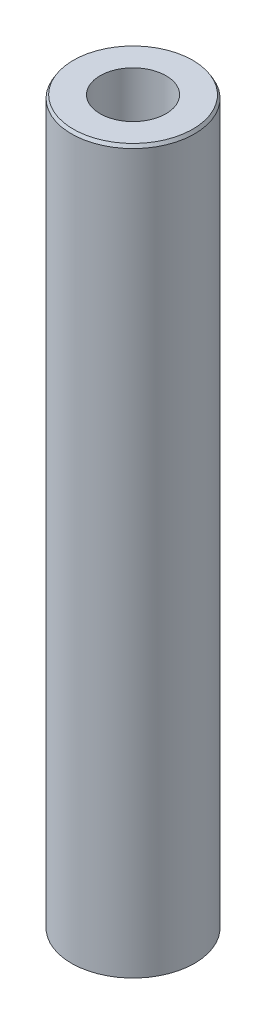
ISO-10303-21;
HEADER;
FILE_DESCRIPTION(('STEP AP214'),'2;1');
FILE_NAME('part.step','',(''),(''),'','','');
FILE_SCHEMA(('AUTOMOTIVE_DESIGN { 1 0 10303 214 1 1 1 1 }'));
ENDSEC;
DATA;
#1=APPLICATION_CONTEXT('core data for automotive mechanical design processes');
#2=APPLICATION_PROTOCOL_DEFINITION('international standard','automotive_design',2000,#1);
#3=PRODUCT_CONTEXT('',#1,'mechanical');
#4=PRODUCT('Part','Part','',(#3));
#5=PRODUCT_RELATED_PRODUCT_CATEGORY('part','',(#4));
#6=PRODUCT_DEFINITION_FORMATION('','',#4);
#7=PRODUCT_DEFINITION_CONTEXT('part definition',#1,'design');
#8=PRODUCT_DEFINITION('design','',#6,#7);
#9=PRODUCT_DEFINITION_SHAPE('','',#8);
#10=(LENGTH_UNIT() NAMED_UNIT(*) SI_UNIT(.MILLI.,.METRE.));
#11=(NAMED_UNIT(*) PLANE_ANGLE_UNIT() SI_UNIT($,.RADIAN.));
#12=(NAMED_UNIT(*) SI_UNIT($,.STERADIAN.) SOLID_ANGLE_UNIT());
#13=UNCERTAINTY_MEASURE_WITH_UNIT(LENGTH_MEASURE(1.E-05),#10,'distance_accuracy_value','');
#14=(GEOMETRIC_REPRESENTATION_CONTEXT(3) GLOBAL_UNCERTAINTY_ASSIGNED_CONTEXT((#13)) GLOBAL_UNIT_ASSIGNED_CONTEXT((#10,
#11,#12)) REPRESENTATION_CONTEXT('',''));
#15=CARTESIAN_POINT('',(0.,0.,0.));
#16=DIRECTION('',(0.,0.,1.));
#17=DIRECTION('',(1.,0.,0.));
#18=AXIS2_PLACEMENT_3D('',#15,#16,#17);
#19=CARTESIAN_POINT('',(0.,293.802868765202,0.));
#20=DIRECTION('',(0.,-1.,0.));
#21=DIRECTION('',(0.,0.,-1.));
#22=AXIS2_PLACEMENT_3D('',#19,#20,#21);
#23=CYLINDRICAL_SURFACE('',#22,25.);
#24=CARTESIAN_POINT('',(0.,292.517660597659,0.));
#25=DIRECTION('',(0.,1.,0.));
#26=DIRECTION('',(0.,0.,1.));
#27=AXIS2_PLACEMENT_3D('',#24,#25,#26);
#28=CIRCLE('',#27,25.);
#29=CARTESIAN_POINT('',(0.,292.517660597659,-25.));
#30=VERTEX_POINT('',#29);
#31=EDGE_CURVE('E50',#30,#30,#28,.F.);
#32=CARTESIAN_POINT('',(0.,0.742015281495589,0.));
#33=DIRECTION('',(0.,1.,0.));
#34=DIRECTION('',(0.,0.,1.));
#35=AXIS2_PLACEMENT_3D('',#32,#33,#34);
#36=CIRCLE('',#35,25.);
#37=CARTESIAN_POINT('',(0.,0.742015281495589,-25.));
#38=VERTEX_POINT('',#37);
#39=EDGE_CURVE('E51',#38,#38,#36,.T.);
#40=CARTESIAN_POINT('',(0.,292.517660597659,-25.));
#41=CARTESIAN_POINT('',(0.,289.478330958949,-25.));
#42=CARTESIAN_POINT('',(0.,286.439001320239,-25.));
#43=CARTESIAN_POINT('',(0.,280.360342042819,-25.));
#44=CARTESIAN_POINT('',(0.,277.321012404109,-25.));
#45=CARTESIAN_POINT('',(0.,271.242353126689,-25.));
#46=CARTESIAN_POINT('',(0.,268.203023487979,-25.));
#47=CARTESIAN_POINT('',(0.,262.124364210558,-25.));
#48=CARTESIAN_POINT('',(0.,259.085034571848,-25.));
#49=CARTESIAN_POINT('',(0.,253.006375294428,-25.));
#50=CARTESIAN_POINT('',(0.,249.967045655718,-25.));
#51=CARTESIAN_POINT('',(0.,243.888386378298,-25.));
#52=CARTESIAN_POINT('',(0.,240.849056739588,-25.));
#53=CARTESIAN_POINT('',(0.,234.770397462168,-25.));
#54=CARTESIAN_POINT('',(0.,231.731067823458,-25.));
#55=CARTESIAN_POINT('',(0.,225.652408546038,-25.));
#56=CARTESIAN_POINT('',(0.,222.613078907328,-25.));
#57=CARTESIAN_POINT('',(0.,216.534419629908,-25.));
#58=CARTESIAN_POINT('',(0.,213.495089991198,-25.));
#59=CARTESIAN_POINT('',(0.,207.416430713778,-25.));
#60=CARTESIAN_POINT('',(0.,204.377101075068,-25.));
#61=CARTESIAN_POINT('',(0.,198.298441797648,-25.));
#62=CARTESIAN_POINT('',(0.,195.259112158938,-25.));
#63=CARTESIAN_POINT('',(0.,189.180452881518,-25.));
#64=CARTESIAN_POINT('',(0.,186.141123242808,-25.));
#65=CARTESIAN_POINT('',(0.,180.062463965388,-25.));
#66=CARTESIAN_POINT('',(0.,177.023134326678,-25.));
#67=CARTESIAN_POINT('',(0.,170.944475049257,-25.));
#68=CARTESIAN_POINT('',(0.,167.905145410547,-25.));
#69=CARTESIAN_POINT('',(0.,161.826486133127,-25.));
#70=CARTESIAN_POINT('',(0.,158.787156494417,-25.));
#71=CARTESIAN_POINT('',(0.,152.708497216997,-25.));
#72=CARTESIAN_POINT('',(0.,149.669167578287,-25.));
#73=CARTESIAN_POINT('',(0.,143.590508300867,-25.));
#74=CARTESIAN_POINT('',(0.,140.551178662157,-25.));
#75=CARTESIAN_POINT('',(0.,134.472519384737,-25.));
#76=CARTESIAN_POINT('',(0.,131.433189746027,-25.));
#77=CARTESIAN_POINT('',(0.,125.354530468607,-25.));
#78=CARTESIAN_POINT('',(0.,122.315200829897,-25.));
#79=CARTESIAN_POINT('',(0.,116.236541552477,-25.));
#80=CARTESIAN_POINT('',(0.,113.197211913767,-25.));
#81=CARTESIAN_POINT('',(0.,107.118552636347,-25.));
#82=CARTESIAN_POINT('',(0.,104.079222997637,-25.));
#83=CARTESIAN_POINT('',(0.,98.0005637202167,-25.));
#84=CARTESIAN_POINT('',(0.,94.9612340815066,-25.));
#85=CARTESIAN_POINT('',(0.,88.8825748040866,-25.));
#86=CARTESIAN_POINT('',(0.,85.8432451653765,-25.));
#87=CARTESIAN_POINT('',(0.,79.7645858879565,-25.));
#88=CARTESIAN_POINT('',(0.,76.7252562492464,-25.));
#89=CARTESIAN_POINT('',(0.,70.6465969718264,-25.));
#90=CARTESIAN_POINT('',(0.,67.6072673331163,-25.));
#91=CARTESIAN_POINT('',(0.,61.5286080556963,-25.));
#92=CARTESIAN_POINT('',(0.,58.4892784169863,-25.));
#93=CARTESIAN_POINT('',(0.,52.4106191395662,-25.));
#94=CARTESIAN_POINT('',(0.,49.3712895008562,-25.));
#95=CARTESIAN_POINT('',(0.,43.2926302234361,-25.));
#96=CARTESIAN_POINT('',(0.,40.2533005847261,-25.));
#97=CARTESIAN_POINT('',(0.,34.174641307306,-25.));
#98=CARTESIAN_POINT('',(0.,31.1353116685959,-25.));
#99=CARTESIAN_POINT('',(0.,25.0566523911759,-25.));
#100=CARTESIAN_POINT('',(0.,22.0173227524659,-25.));
#101=CARTESIAN_POINT('',(0.,15.9386634750458,-25.));
#102=CARTESIAN_POINT('',(0.,12.8993338363358,-25.));
#103=CARTESIAN_POINT('',(0.,6.82067455891568,-25.));
#104=CARTESIAN_POINT('',(0.,3.78134492020563,-25.));
#105=CARTESIAN_POINT('',(0.,0.742015281495589,-25.));
#106=B_SPLINE_CURVE_WITH_KNOTS('',3,(#40,#41,#42,#43,#44,#45,#46,#47,#48,#49,#50,#51,#52,#53,
#54,#55,#56,#57,#58,#59,#60,#61,#62,#63,#64,#65,#66,#67,#68,#69,#70,#71,#72,#73,#74,#75,#76,#77,
#78,#79,#80,#81,#82,#83,#84,#85,#86,#87,#88,#89,#90,#91,#92,#93,#94,#95,#96,#97,#98,#99,#100,
#101,#102,#103,#104,#105),.UNSPECIFIED.,.F.,.F.,(4,2,2,2,2,2,2,2,2,2,2,2,2,2,2,2,2,2,2,2,2,2,2,
2,2,2,2,2,2,2,2,2,4),(0.,9.11798891613014,18.2359778322602,27.3539667483903,36.4719556645204,
45.5899445806505,54.7079334967806,63.8259224129107,72.9439113290408,82.0619002451709,
91.179889161301,100.297878077431,109.415866993561,118.533855909691,127.651844825821,
136.769833741952,145.887822658082,155.005811574212,164.123800490342,173.241789406472,
182.359778322602,191.477767238732,200.595756154862,209.713745070992,218.831733987122,
227.949722903253,237.067711819383,246.185700735513,255.303689651643,264.421678567773,
273.539667483903,282.657656400033,291.775645316163),.UNSPECIFIED.);
#107=EDGE_CURVE('BSEAM39',#30,#38,#106,.T.);
#108=ORIENTED_EDGE('',*,*,#31,.T.);
#109=ORIENTED_EDGE('',*,*,#39,.T.);
#110=ORIENTED_EDGE('',*,*,#107,.T.);
#111=ORIENTED_EDGE('',*,*,#107,.F.);
#112=EDGE_LOOP('',(#108,#110,#109,#111));
#113=FACE_BOUND('',#112,.T.);
#114=ADVANCED_FACE('F39',(#113),#23,.T.);
#115=CARTESIAN_POINT('',(0.,293.802868765202,0.));
#116=DIRECTION('',(0.,1.,0.));
#117=DIRECTION('',(0.,0.,1.));
#118=AXIS2_PLACEMENT_3D('',#115,#116,#117);
#119=PLANE('',#118);
#120=CARTESIAN_POINT('',(0.,293.802868765202,0.));
#121=DIRECTION('',(0.,1.,0.));
#122=DIRECTION('',(0.,0.,1.));
#123=AXIS2_PLACEMENT_3D('',#120,#121,#122);
#124=CIRCLE('',#123,24.2579847185044);
#125=CARTESIAN_POINT('',(0.,293.802868765202,-24.2579847185044));
#126=VERTEX_POINT('',#125);
#127=EDGE_CURVE('E54',#126,#126,#124,.T.);
#128=ORIENTED_EDGE('',*,*,#127,.T.);
#129=EDGE_LOOP('',(#128));
#130=FACE_BOUND('',#129,.T.);
#131=CARTESIAN_POINT('',(0.,293.802868765202,0.));
#132=DIRECTION('',(0.,1.,0.));
#133=DIRECTION('',(0.,0.,1.));
#134=AXIS2_PLACEMENT_3D('',#131,#132,#133);
#135=CIRCLE('',#134,13.3875926501287);
#136=CARTESIAN_POINT('',(0.,293.802868765202,13.3875926501287));
#137=VERTEX_POINT('',#136);
#138=EDGE_CURVE('E58',#137,#137,#135,.T.);
#139=ORIENTED_EDGE('',*,*,#138,.F.);
#140=EDGE_LOOP('',(#139));
#141=FACE_BOUND('',#140,.T.);
#142=ADVANCED_FACE('F69',(#130,#141),#119,.T.);
#143=CARTESIAN_POINT('',(0.,0.,0.));
#144=DIRECTION('',(0.,1.,0.));
#145=DIRECTION('',(0.,0.,1.));
#146=AXIS2_PLACEMENT_3D('',#143,#144,#145);
#147=PLANE('',#146);
#148=CARTESIAN_POINT('',(0.,0.,0.));
#149=DIRECTION('',(0.,1.,0.));
#150=DIRECTION('',(0.,0.,1.));
#151=AXIS2_PLACEMENT_3D('',#148,#149,#150);
#152=CIRCLE('',#151,23.7147918324571);
#153=CARTESIAN_POINT('',(0.,0.,23.7147918324571));
#154=VERTEX_POINT('',#153);
#155=EDGE_CURVE('E10',#154,#154,#152,.F.);
#156=ORIENTED_EDGE('',*,*,#155,.T.);
#157=EDGE_LOOP('',(#156));
#158=FACE_BOUND('',#157,.T.);
#159=CARTESIAN_POINT('',(0.,0.,0.));
#160=DIRECTION('',(0.,1.,0.));
#161=DIRECTION('',(0.,0.,1.));
#162=AXIS2_PLACEMENT_3D('',#159,#160,#161);
#163=CIRCLE('',#162,13.3875926501287);
#164=CARTESIAN_POINT('',(0.,0.,13.3875926501287));
#165=VERTEX_POINT('',#164);
#166=EDGE_CURVE('E63',#165,#165,#163,.T.);
#167=ORIENTED_EDGE('',*,*,#166,.T.);
#168=EDGE_LOOP('',(#167));
#169=FACE_BOUND('',#168,.T.);
#170=ADVANCED_FACE('F75',(#158,#169),#147,.F.);
#171=CARTESIAN_POINT('',(0.,293.802868765202,0.));
#172=DIRECTION('',(0.,-1.,0.));
#173=DIRECTION('',(0.,0.,-1.));
#174=AXIS2_PLACEMENT_3D('',#171,#172,#173);
#175=CYLINDRICAL_SURFACE('',#174,13.3875926501287);
#176=ORIENTED_EDGE('',*,*,#138,.T.);
#177=EDGE_LOOP('',(#176));
#178=FACE_BOUND('',#177,.T.);
#179=ORIENTED_EDGE('',*,*,#166,.F.);
#180=EDGE_LOOP('',(#179));
#181=FACE_BOUND('',#180,.T.);
#182=ADVANCED_FACE('F70',(#178,#181),#175,.F.);
#183=CARTESIAN_POINT('',(0.,293.802868765202,0.));
#184=DIRECTION('',(0.,-1.,0.));
#185=DIRECTION('',(0.,0.,-1.));
#186=AXIS2_PLACEMENT_3D('',#183,#184,#185);
#187=CONICAL_SURFACE('',#186,24.2579847185044,0.523598775598295);
#188=CARTESIAN_POINT('',(0.,292.517660597659,-25.));
#189=CARTESIAN_POINT('',(0.,292.531048182737,-24.9922706741511));
#190=CARTESIAN_POINT('',(0.,292.544435767816,-24.9845413483022));
#191=CARTESIAN_POINT('',(0.,292.571210937973,-24.9690826966044));
#192=CARTESIAN_POINT('',(0.,292.584598523052,-24.9613533707555));
#193=CARTESIAN_POINT('',(0.,292.611373693209,-24.9458947190576));
#194=CARTESIAN_POINT('',(0.,292.624761278287,-24.9381653932087));
#195=CARTESIAN_POINT('',(0.,292.651536448445,-24.9227067415109));
#196=CARTESIAN_POINT('',(0.,292.664924033523,-24.914977415662));
#197=CARTESIAN_POINT('',(0.,292.69169920368,-24.8995187639642));
#198=CARTESIAN_POINT('',(0.,292.705086788759,-24.8917894381152));
#199=CARTESIAN_POINT('',(0.,292.731861958916,-24.8763307864174));
#200=CARTESIAN_POINT('',(0.,292.745249543994,-24.8686014605685));
#201=CARTESIAN_POINT('',(0.,292.772024714152,-24.8531428088707));
#202=CARTESIAN_POINT('',(0.,292.78541229923,-24.8454134830218));
#203=CARTESIAN_POINT('',(0.,292.812187469387,-24.8299548313239));
#204=CARTESIAN_POINT('',(0.,292.825575054466,-24.822225505475));
#205=CARTESIAN_POINT('',(0.,292.852350224623,-24.8067668537772));
#206=CARTESIAN_POINT('',(0.,292.865737809702,-24.7990375279283));
#207=CARTESIAN_POINT('',(0.,292.892512979859,-24.7835788762305));
#208=CARTESIAN_POINT('',(0.,292.905900564937,-24.7758495503816));
#209=CARTESIAN_POINT('',(0.,292.932675735095,-24.7603908986837));
#210=CARTESIAN_POINT('',(0.,292.946063320173,-24.7526615728348));
#211=CARTESIAN_POINT('',(0.,292.97283849033,-24.737202921137));
#212=CARTESIAN_POINT('',(0.,292.986226075409,-24.7294735952881));
#213=CARTESIAN_POINT('',(0.,293.013001245566,-24.7140149435903));
#214=CARTESIAN_POINT('',(0.,293.026388830645,-24.7062856177413));
#215=CARTESIAN_POINT('',(0.,293.053164000802,-24.6908269660435));
#216=CARTESIAN_POINT('',(0.,293.06655158588,-24.6830976401946));
#217=CARTESIAN_POINT('',(0.,293.093326756037,-24.6676389884968));
#218=CARTESIAN_POINT('',(0.,293.106714341116,-24.6599096626479));
#219=CARTESIAN_POINT('',(0.,293.133489511273,-24.64445101095));
#220=CARTESIAN_POINT('',(0.,293.146877096352,-24.6367216851011));
#221=CARTESIAN_POINT('',(0.,293.173652266509,-24.6212630334033));
#222=CARTESIAN_POINT('',(0.,293.187039851587,-24.6135337075544));
#223=CARTESIAN_POINT('',(0.,293.213815021745,-24.5980750558566));
#224=CARTESIAN_POINT('',(0.,293.227202606823,-24.5903457300077));
#225=CARTESIAN_POINT('',(0.,293.25397777698,-24.5748870783098));
#226=CARTESIAN_POINT('',(0.,293.267365362059,-24.5671577524609));
#227=CARTESIAN_POINT('',(0.,293.294140532216,-24.5516991007631));
#228=CARTESIAN_POINT('',(0.,293.307528117295,-24.5439697749142));
#229=CARTESIAN_POINT('',(0.,293.334303287452,-24.5285111232164));
#230=CARTESIAN_POINT('',(0.,293.34769087253,-24.5207817973674));
#231=CARTESIAN_POINT('',(0.,293.374466042687,-24.5053231456696));
#232=CARTESIAN_POINT('',(0.,293.387853627766,-24.4975938198207));
#233=CARTESIAN_POINT('',(0.,293.414628797923,-24.4821351681229));
#234=CARTESIAN_POINT('',(0.,293.428016383002,-24.474405842274));
#235=CARTESIAN_POINT('',(0.,293.454791553159,-24.4589471905761));
#236=CARTESIAN_POINT('',(0.,293.468179138237,-24.4512178647272));
#237=CARTESIAN_POINT('',(0.,293.494954308395,-24.4357592130294));
#238=CARTESIAN_POINT('',(0.,293.508341893473,-24.4280298871805));
#239=CARTESIAN_POINT('',(0.,293.53511706363,-24.4125712354827));
#240=CARTESIAN_POINT('',(0.,293.548504648709,-24.4048419096338));
#241=CARTESIAN_POINT('',(0.,293.575279818866,-24.3893832579359));
#242=CARTESIAN_POINT('',(0.,293.588667403945,-24.381653932087));
#243=CARTESIAN_POINT('',(0.,293.615442574102,-24.3661952803892));
#244=CARTESIAN_POINT('',(0.,293.62883015918,-24.3584659545403));
#245=CARTESIAN_POINT('',(0.,293.655605329337,-24.3430073028425));
#246=CARTESIAN_POINT('',(0.,293.668992914416,-24.3352779769935));
#247=CARTESIAN_POINT('',(0.,293.695768084573,-24.3198193252957));
#248=CARTESIAN_POINT('',(0.,293.709155669652,-24.3120899994468));
#249=CARTESIAN_POINT('',(0.,293.735930839809,-24.296631347749));
#250=CARTESIAN_POINT('',(0.,293.749318424887,-24.2889020219001));
#251=CARTESIAN_POINT('',(0.,293.776093595045,-24.2734433702022));
#252=CARTESIAN_POINT('',(0.,293.789481180123,-24.2657140443533));
#253=CARTESIAN_POINT('',(0.,293.802868765202,-24.2579847185044));
#254=B_SPLINE_CURVE_WITH_KNOTS('',3,(#188,#189,#190,#191,#192,#193,#194,#195,#196,#197,#198,
#199,#200,#201,#202,#203,#204,#205,#206,#207,#208,#209,#210,#211,#212,#213,#214,#215,#216,#217,
#218,#219,#220,#221,#222,#223,#224,#225,#226,#227,#228,#229,#230,#231,#232,#233,#234,#235,#236,
#237,#238,#239,#240,#241,#242,#243,#244,#245,#246,#247,#248,#249,#250,#251,#252,#253),
.UNSPECIFIED.,.F.,.F.,(4,2,2,2,2,2,2,2,2,2,2,2,2,2,2,2,2,2,2,2,2,2,2,2,2,2,2,2,2,2,2,2,4),(0.,
0.0463759550934773,0.0927519101869529,0.13912786528043,0.185503820373908,0.231879775467383,
0.27825573056086,0.324631685654336,0.371007640747813,0.417383595841289,0.463759550934766,
0.510135506028244,0.556511461121719,0.602887416215196,0.649263371308672,0.69563932640215,
0.742015281495625,0.788391236589102,0.834767191682578,0.881143146776056,0.927519101869533,
0.973895056963008,1.02027101205649,1.06664696714996,1.11302292224344,1.15939887733691,
1.20577483243039,1.25215078752387,1.29852674261735,1.34490269771082,1.3912786528043,
1.43765460789778,1.48403056299125),.UNSPECIFIED.);
#255=EDGE_CURVE('BSEAM81',#30,#126,#254,.T.);
#256=ORIENTED_EDGE('',*,*,#31,.F.);
#257=ORIENTED_EDGE('',*,*,#127,.F.);
#258=ORIENTED_EDGE('',*,*,#255,.T.);
#259=ORIENTED_EDGE('',*,*,#255,.F.);
#260=EDGE_LOOP('',(#256,#258,#257,#259));
#261=FACE_BOUND('',#260,.T.);
#262=ADVANCED_FACE('F81',(#261),#187,.T.);
#263=CARTESIAN_POINT('',(0.,0.742015281495589,0.));
#264=DIRECTION('',(0.,1.,0.));
#265=DIRECTION('',(0.,0.,1.));
#266=AXIS2_PLACEMENT_3D('',#263,#264,#265);
#267=CONICAL_SURFACE('',#266,25.,1.04719755119661);
#268=ORIENTED_EDGE('',*,*,#155,.F.);
#269=EDGE_LOOP('',(#268));
#270=FACE_BOUND('',#269,.T.);
#271=ORIENTED_EDGE('',*,*,#39,.F.);
#272=EDGE_LOOP('',(#271));
#273=FACE_BOUND('',#272,.T.);
#274=ADVANCED_FACE('F45',(#270,#273),#267,.T.);
#275=CLOSED_SHELL('',(#114,#142,#170,#182,#262,#274));
#276=MANIFOLD_SOLID_BREP('B2',#275);
#277=ADVANCED_BREP_SHAPE_REPRESENTATION('',(#18,#276),#14);
#278=SHAPE_DEFINITION_REPRESENTATION(#9,#277);
ENDSEC;
END-ISO-10303-21;
